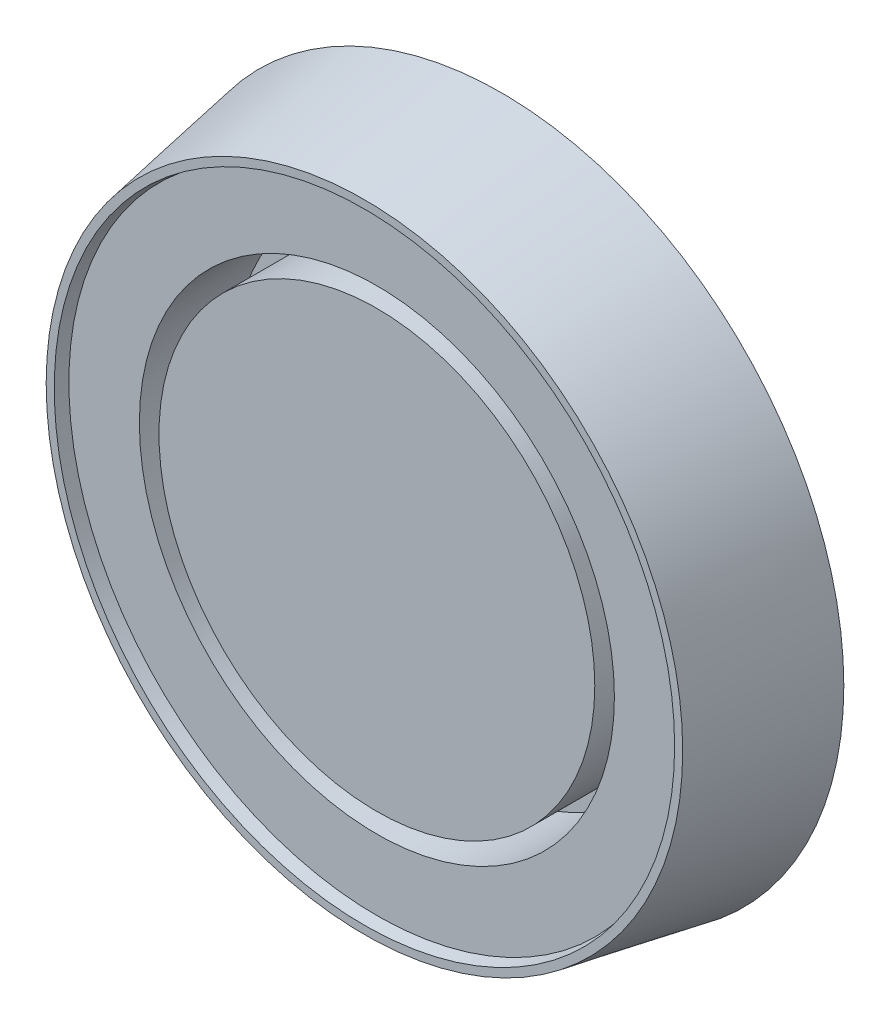
ISO-10303-21;
HEADER;
FILE_DESCRIPTION(('STEP AP214'),'2;1');
FILE_NAME('part.step','',(''),(''),'','','');
FILE_SCHEMA(('AUTOMOTIVE_DESIGN { 1 0 10303 214 1 1 1 1 }'));
ENDSEC;
DATA;
#1=APPLICATION_CONTEXT('core data for automotive mechanical design processes');
#2=APPLICATION_PROTOCOL_DEFINITION('international standard','automotive_design',2000,#1);
#3=PRODUCT_CONTEXT('',#1,'mechanical');
#4=PRODUCT('Part','Part','',(#3));
#5=PRODUCT_RELATED_PRODUCT_CATEGORY('part','',(#4));
#6=PRODUCT_DEFINITION_FORMATION('','',#4);
#7=PRODUCT_DEFINITION_CONTEXT('part definition',#1,'design');
#8=PRODUCT_DEFINITION('design','',#6,#7);
#9=PRODUCT_DEFINITION_SHAPE('','',#8);
#10=(LENGTH_UNIT() NAMED_UNIT(*) SI_UNIT(.MILLI.,.METRE.));
#11=(NAMED_UNIT(*) PLANE_ANGLE_UNIT() SI_UNIT($,.RADIAN.));
#12=(NAMED_UNIT(*) SI_UNIT($,.STERADIAN.) SOLID_ANGLE_UNIT());
#13=UNCERTAINTY_MEASURE_WITH_UNIT(LENGTH_MEASURE(1.E-05),#10,'distance_accuracy_value','');
#14=(GEOMETRIC_REPRESENTATION_CONTEXT(3) GLOBAL_UNCERTAINTY_ASSIGNED_CONTEXT((#13)) GLOBAL_UNIT_ASSIGNED_CONTEXT((#10,
#11,#12)) REPRESENTATION_CONTEXT('',''));
#15=CARTESIAN_POINT('',(0.,0.,0.));
#16=DIRECTION('',(0.,0.,1.));
#17=DIRECTION('',(1.,0.,0.));
#18=AXIS2_PLACEMENT_3D('',#15,#16,#17);
#19=CARTESIAN_POINT('',(0.,0.,20.));
#20=DIRECTION('',(0.,0.,1.));
#21=DIRECTION('',(1.,0.,0.));
#22=AXIS2_PLACEMENT_3D('',#19,#20,#21);
#23=PLANE('',#22);
#24=CARTESIAN_POINT('',(0.,0.,20.));
#25=DIRECTION('',(0.,0.,1.));
#26=DIRECTION('',(1.,0.,0.));
#27=AXIS2_PLACEMENT_3D('',#24,#25,#26);
#28=CIRCLE('',#27,38.15);
#29=CARTESIAN_POINT('',(38.15,0.,20.));
#30=VERTEX_POINT('',#29);
#31=EDGE_CURVE('E54',#30,#30,#28,.T.);
#32=ORIENTED_EDGE('',*,*,#31,.F.);
#33=EDGE_LOOP('',(#32));
#34=FACE_BOUND('',#33,.T.);
#35=CARTESIAN_POINT('',(0.,0.,20.));
#36=DIRECTION('',(0.,0.,1.));
#37=DIRECTION('',(1.,0.,0.));
#38=AXIS2_PLACEMENT_3D('',#35,#36,#37);
#39=CIRCLE('',#38,49.4734603858307);
#40=CARTESIAN_POINT('',(49.4734603858307,0.,20.));
#41=VERTEX_POINT('',#40);
#42=EDGE_CURVE('E11',#41,#41,#39,.F.);
#43=ORIENTED_EDGE('',*,*,#42,.F.);
#44=EDGE_LOOP('',(#43));
#45=FACE_BOUND('',#44,.T.);
#46=ADVANCED_FACE('F36',(#34,#45),#23,.T.);
#47=CARTESIAN_POINT('',(0.,0.,-107.904494809067));
#48=DIRECTION('',(0.,0.,1.));
#49=DIRECTION('',(1.,0.,0.));
#50=AXIS2_PLACEMENT_3D('',#47,#48,#49);
#51=CYLINDRICAL_SURFACE('',#50,38.15);
#52=CARTESIAN_POINT('',(0.,0.,5.));
#53=DIRECTION('',(0.,0.,1.));
#54=DIRECTION('',(1.,0.,0.));
#55=AXIS2_PLACEMENT_3D('',#52,#53,#54);
#56=CIRCLE('',#55,38.15);
#57=CARTESIAN_POINT('',(38.15,0.,5.));
#58=VERTEX_POINT('',#57);
#59=EDGE_CURVE('E51',#58,#58,#56,.F.);
#60=ORIENTED_EDGE('',*,*,#59,.T.);
#61=EDGE_LOOP('',(#60));
#62=FACE_BOUND('',#61,.T.);
#63=ORIENTED_EDGE('',*,*,#31,.T.);
#64=EDGE_LOOP('',(#63));
#65=FACE_BOUND('',#64,.T.);
#66=ADVANCED_FACE('F80',(#62,#65),#51,.F.);
#67=CARTESIAN_POINT('',(0.,0.,-107.904494809067));
#68=DIRECTION('',(0.,0.,1.));
#69=DIRECTION('',(1.,0.,0.));
#70=AXIS2_PLACEMENT_3D('',#67,#68,#69);
#71=CYLINDRICAL_SURFACE('',#70,35.);
#72=CARTESIAN_POINT('',(0.,0.,5.));
#73=DIRECTION('',(0.,0.,1.));
#74=DIRECTION('',(1.,0.,0.));
#75=AXIS2_PLACEMENT_3D('',#72,#73,#74);
#76=CIRCLE('',#75,35.);
#77=CARTESIAN_POINT('',(35.,0.,5.));
#78=VERTEX_POINT('',#77);
#79=EDGE_CURVE('E47',#78,#78,#76,.F.);
#80=ORIENTED_EDGE('',*,*,#79,.F.);
#81=EDGE_LOOP('',(#80));
#82=FACE_BOUND('',#81,.T.);
#83=CARTESIAN_POINT('',(0.,0.,20.));
#84=DIRECTION('',(0.,0.,1.));
#85=DIRECTION('',(1.,0.,0.));
#86=AXIS2_PLACEMENT_3D('',#83,#84,#85);
#87=CIRCLE('',#86,35.);
#88=CARTESIAN_POINT('',(35.,0.,20.));
#89=VERTEX_POINT('',#88);
#90=EDGE_CURVE('E57',#89,#89,#87,.T.);
#91=ORIENTED_EDGE('',*,*,#90,.F.);
#92=EDGE_LOOP('',(#91));
#93=FACE_BOUND('',#92,.T.);
#94=ADVANCED_FACE('F87',(#82,#93),#71,.T.);
#95=CARTESIAN_POINT('',(0.,0.,5.));
#96=DIRECTION('',(0.,0.,1.));
#97=DIRECTION('',(1.,0.,0.));
#98=AXIS2_PLACEMENT_3D('',#95,#96,#97);
#99=PLANE('',#98);
#100=ORIENTED_EDGE('',*,*,#59,.F.);
#101=EDGE_LOOP('',(#100));
#102=FACE_BOUND('',#101,.T.);
#103=ORIENTED_EDGE('',*,*,#79,.T.);
#104=EDGE_LOOP('',(#103));
#105=FACE_BOUND('',#104,.T.);
#106=ADVANCED_FACE('F93',(#102,#105),#99,.T.);
#107=ORIENTED_EDGE('',*,*,#90,.T.);
#108=EDGE_LOOP('',(#107));
#109=FACE_BOUND('',#108,.T.);
#110=ADVANCED_FACE('F83',(#109),#23,.T.);
#111=CARTESIAN_POINT('',(0.,0.,22.));
#112=DIRECTION('',(0.,0.,1.));
#113=DIRECTION('',(1.,0.,0.));
#114=AXIS2_PLACEMENT_3D('',#111,#112,#113);
#115=PLANE('',#114);
#116=CARTESIAN_POINT('',(0.,0.,22.));
#117=DIRECTION('',(0.,0.,1.));
#118=DIRECTION('',(1.,0.,0.));
#119=AXIS2_PLACEMENT_3D('',#116,#117,#118);
#120=CIRCLE('',#119,51.1208064244138);
#121=CARTESIAN_POINT('',(51.1208064244138,0.,22.));
#122=VERTEX_POINT('',#121);
#123=EDGE_CURVE('E60',#122,#122,#120,.T.);
#124=ORIENTED_EDGE('',*,*,#123,.T.);
#125=EDGE_LOOP('',(#124));
#126=FACE_BOUND('',#125,.T.);
#127=CARTESIAN_POINT('',(0.,0.,22.));
#128=DIRECTION('',(0.,0.,1.));
#129=DIRECTION('',(1.,0.,0.));
#130=AXIS2_PLACEMENT_3D('',#127,#128,#129);
#131=CIRCLE('',#130,49.8261143472476);
#132=CARTESIAN_POINT('',(49.8261143472476,0.,22.));
#133=VERTEX_POINT('',#132);
#134=EDGE_CURVE('E63',#133,#133,#131,.T.);
#135=ORIENTED_EDGE('',*,*,#134,.F.);
#136=EDGE_LOOP('',(#135));
#137=FACE_BOUND('',#136,.T.);
#138=ADVANCED_FACE('F69',(#126,#137),#115,.T.);
#139=CARTESIAN_POINT('',(0.,0.,20.));
#140=DIRECTION('',(0.,0.,1.));
#141=DIRECTION('',(1.,0.,0.));
#142=AXIS2_PLACEMENT_3D('',#139,#140,#141);
#143=CONICAL_SURFACE('',#142,49.4734603858307,0.174532925199433);
#144=ORIENTED_EDGE('',*,*,#134,.T.);
#145=EDGE_LOOP('',(#144));
#146=FACE_BOUND('',#145,.T.);
#147=ORIENTED_EDGE('',*,*,#42,.T.);
#148=EDGE_LOOP('',(#147));
#149=FACE_BOUND('',#148,.T.);
#150=ADVANCED_FACE('F77',(#146,#149),#143,.F.);
#151=CARTESIAN_POINT('',(0.,0.,0.));
#152=DIRECTION('',(0.,0.,1.));
#153=DIRECTION('',(1.,0.,0.));
#154=AXIS2_PLACEMENT_3D('',#151,#152,#153);
#155=PLANE('',#154);
#156=CARTESIAN_POINT('',(0.,0.,0.));
#157=DIRECTION('',(0.,0.,1.));
#158=DIRECTION('',(1.,0.,0.));
#159=AXIS2_PLACEMENT_3D('',#156,#157,#158);
#160=CIRCLE('',#159,55.);
#161=CARTESIAN_POINT('',(55.,0.,0.));
#162=VERTEX_POINT('',#161);
#163=EDGE_CURVE('E43',#162,#162,#160,.T.);
#164=ORIENTED_EDGE('',*,*,#163,.F.);
#165=EDGE_LOOP('',(#164));
#166=FACE_BOUND('',#165,.T.);
#167=ADVANCED_FACE('F73',(#166),#155,.F.);
#168=CARTESIAN_POINT('',(0.,0.,0.));
#169=DIRECTION('',(0.,0.,-1.));
#170=DIRECTION('',(1.,0.,0.));
#171=AXIS2_PLACEMENT_3D('',#168,#169,#170);
#172=CONICAL_SURFACE('',#171,55.,0.174532925199433);
#173=ORIENTED_EDGE('',*,*,#163,.T.);
#174=EDGE_LOOP('',(#173));
#175=FACE_BOUND('',#174,.T.);
#176=ORIENTED_EDGE('',*,*,#123,.F.);
#177=EDGE_LOOP('',(#176));
#178=FACE_BOUND('',#177,.T.);
#179=ADVANCED_FACE('F38',(#175,#178),#172,.T.);
#180=CLOSED_SHELL('',(#46,#66,#94,#106,#110,#138,#150,#167,#179));
#181=MANIFOLD_SOLID_BREP('B2',#180);
#182=ADVANCED_BREP_SHAPE_REPRESENTATION('',(#18,#181),#14);
#183=SHAPE_DEFINITION_REPRESENTATION(#9,#182);
ENDSEC;
END-ISO-10303-21;
